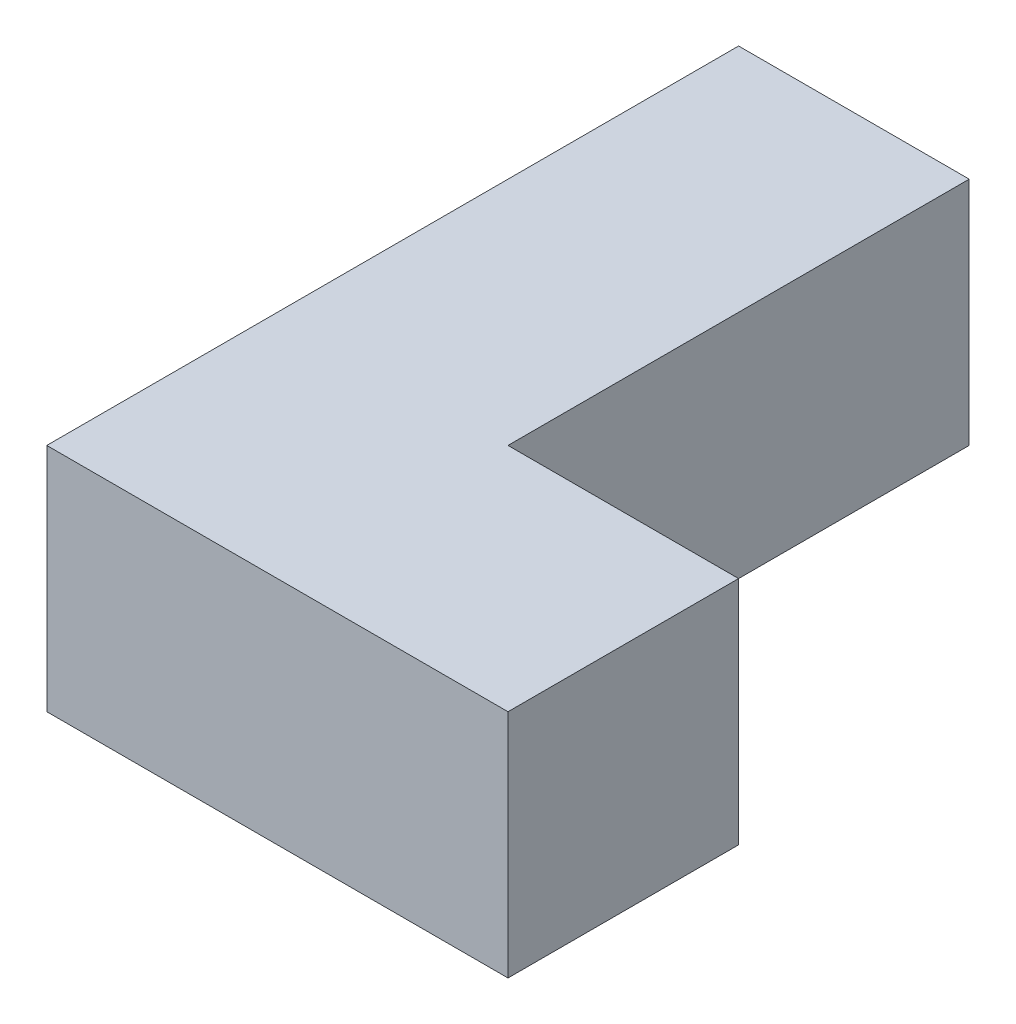
ISO-10303-21;
HEADER;
FILE_DESCRIPTION(('STEP AP214'),'2;1');
FILE_NAME('part.step','',(''),(''),'','','');
FILE_SCHEMA(('AUTOMOTIVE_DESIGN { 1 0 10303 214 1 1 1 1 }'));
ENDSEC;
DATA;
#1=APPLICATION_CONTEXT('core data for automotive mechanical design processes');
#2=APPLICATION_PROTOCOL_DEFINITION('international standard','automotive_design',2000,#1);
#3=PRODUCT_CONTEXT('',#1,'mechanical');
#4=PRODUCT('Part','Part','',(#3));
#5=PRODUCT_RELATED_PRODUCT_CATEGORY('part','',(#4));
#6=PRODUCT_DEFINITION_FORMATION('','',#4);
#7=PRODUCT_DEFINITION_CONTEXT('part definition',#1,'design');
#8=PRODUCT_DEFINITION('design','',#6,#7);
#9=PRODUCT_DEFINITION_SHAPE('','',#8);
#10=(LENGTH_UNIT() NAMED_UNIT(*) SI_UNIT(.MILLI.,.METRE.));
#11=(NAMED_UNIT(*) PLANE_ANGLE_UNIT() SI_UNIT($,.RADIAN.));
#12=(NAMED_UNIT(*) SI_UNIT($,.STERADIAN.) SOLID_ANGLE_UNIT());
#13=UNCERTAINTY_MEASURE_WITH_UNIT(LENGTH_MEASURE(1.E-05),#10,'distance_accuracy_value','');
#14=(GEOMETRIC_REPRESENTATION_CONTEXT(3) GLOBAL_UNCERTAINTY_ASSIGNED_CONTEXT((#13)) GLOBAL_UNIT_ASSIGNED_CONTEXT((#10,
#11,#12)) REPRESENTATION_CONTEXT('',''));
#15=CARTESIAN_POINT('',(0.,0.,0.));
#16=DIRECTION('',(0.,0.,1.));
#17=DIRECTION('',(1.,0.,0.));
#18=AXIS2_PLACEMENT_3D('',#15,#16,#17);
#19=CARTESIAN_POINT('',(0.,5000.,-7500.));
#20=DIRECTION('',(0.,0.,1.));
#21=DIRECTION('',(1.,0.,0.));
#22=AXIS2_PLACEMENT_3D('',#19,#20,#21);
#23=PLANE('',#22);
#24=DIRECTION('',(-1.,0.,0.));
#25=VECTOR('',#24,1.);
#26=CARTESIAN_POINT('',(0.,0.,-7500.));
#27=LINE('',#26,#25);
#28=CARTESIAN_POINT('',(0.,0.,-7500.));
#29=VERTEX_POINT('',#28);
#30=CARTESIAN_POINT('',(-5000.,0.,-7500.));
#31=VERTEX_POINT('',#30);
#32=EDGE_CURVE('E117',#29,#31,#27,.T.);
#33=ORIENTED_EDGE('',*,*,#32,.T.);
#34=DIRECTION('',(0.,-1.,0.));
#35=VECTOR('',#34,1.);
#36=CARTESIAN_POINT('',(-5000.,5000.,-7500.));
#37=LINE('',#36,#35);
#38=CARTESIAN_POINT('',(-5000.,5000.,-7500.));
#39=VERTEX_POINT('',#38);
#40=EDGE_CURVE('E11',#39,#31,#37,.T.);
#41=ORIENTED_EDGE('',*,*,#40,.F.);
#42=DIRECTION('',(-1.,0.,0.));
#43=VECTOR('',#42,1.);
#44=CARTESIAN_POINT('',(0.,5000.,-7500.));
#45=LINE('',#44,#43);
#46=CARTESIAN_POINT('',(0.,5000.,-7500.));
#47=VERTEX_POINT('',#46);
#48=EDGE_CURVE('E127',#47,#39,#45,.T.);
#49=ORIENTED_EDGE('',*,*,#48,.F.);
#50=DIRECTION('',(0.,-1.,0.));
#51=VECTOR('',#50,1.);
#52=CARTESIAN_POINT('',(0.,5000.,-7500.));
#53=LINE('',#52,#51);
#54=EDGE_CURVE('E113',#47,#29,#53,.T.);
#55=ORIENTED_EDGE('',*,*,#54,.T.);
#56=EDGE_LOOP('',(#33,#41,#49,#55));
#57=FACE_BOUND('',#56,.T.);
#58=ADVANCED_FACE('F33',(#57),#23,.F.);
#59=CARTESIAN_POINT('',(-5000.,5000.,-7500.));
#60=DIRECTION('',(1.,0.,0.));
#61=DIRECTION('',(0.,0.,-1.));
#62=AXIS2_PLACEMENT_3D('',#59,#60,#61);
#63=PLANE('',#62);
#64=DIRECTION('',(0.,0.,1.));
#65=VECTOR('',#64,1.);
#66=CARTESIAN_POINT('',(-5000.,0.,-7500.));
#67=LINE('',#66,#65);
#68=CARTESIAN_POINT('',(-5000.,0.,7500.));
#69=VERTEX_POINT('',#68);
#70=EDGE_CURVE('E120',#31,#69,#67,.T.);
#71=ORIENTED_EDGE('',*,*,#70,.T.);
#72=DIRECTION('',(0.,-1.,0.));
#73=VECTOR('',#72,1.);
#74=CARTESIAN_POINT('',(-5000.,5000.,7500.));
#75=LINE('',#74,#73);
#76=CARTESIAN_POINT('',(-5000.,5000.,7500.));
#77=VERTEX_POINT('',#76);
#78=EDGE_CURVE('E41',#77,#69,#75,.T.);
#79=ORIENTED_EDGE('',*,*,#78,.F.);
#80=DIRECTION('',(0.,0.,1.));
#81=VECTOR('',#80,1.);
#82=CARTESIAN_POINT('',(-5000.,5000.,-7500.));
#83=LINE('',#82,#81);
#84=EDGE_CURVE('E86',#39,#77,#83,.T.);
#85=ORIENTED_EDGE('',*,*,#84,.F.);
#86=ORIENTED_EDGE('',*,*,#40,.T.);
#87=EDGE_LOOP('',(#71,#79,#85,#86));
#88=FACE_BOUND('',#87,.T.);
#89=ADVANCED_FACE('F151',(#88),#63,.F.);
#90=CARTESIAN_POINT('',(-5000.,5000.,7500.));
#91=DIRECTION('',(0.,0.,-1.));
#92=DIRECTION('',(-1.,0.,0.));
#93=AXIS2_PLACEMENT_3D('',#90,#91,#92);
#94=PLANE('',#93);
#95=DIRECTION('',(1.,0.,0.));
#96=VECTOR('',#95,1.);
#97=CARTESIAN_POINT('',(-5000.,0.,7500.));
#98=LINE('',#97,#96);
#99=CARTESIAN_POINT('',(5000.,0.,7500.));
#100=VERTEX_POINT('',#99);
#101=EDGE_CURVE('E122',#69,#100,#98,.T.);
#102=ORIENTED_EDGE('',*,*,#101,.T.);
#103=DIRECTION('',(0.,-1.,0.));
#104=VECTOR('',#103,1.);
#105=CARTESIAN_POINT('',(5000.,5000.,7500.));
#106=LINE('',#105,#104);
#107=CARTESIAN_POINT('',(5000.,5000.,7500.));
#108=VERTEX_POINT('',#107);
#109=EDGE_CURVE('E108',#108,#100,#106,.T.);
#110=ORIENTED_EDGE('',*,*,#109,.F.);
#111=DIRECTION('',(1.,0.,0.));
#112=VECTOR('',#111,1.);
#113=CARTESIAN_POINT('',(-5000.,5000.,7500.));
#114=LINE('',#113,#112);
#115=EDGE_CURVE('E99',#77,#108,#114,.T.);
#116=ORIENTED_EDGE('',*,*,#115,.F.);
#117=ORIENTED_EDGE('',*,*,#78,.T.);
#118=EDGE_LOOP('',(#102,#110,#116,#117));
#119=FACE_BOUND('',#118,.T.);
#120=ADVANCED_FACE('F133',(#119),#94,.F.);
#121=CARTESIAN_POINT('',(5000.,5000.,7500.));
#122=DIRECTION('',(-1.,0.,0.));
#123=DIRECTION('',(0.,0.,1.));
#124=AXIS2_PLACEMENT_3D('',#121,#122,#123);
#125=PLANE('',#124);
#126=DIRECTION('',(0.,0.,-1.));
#127=VECTOR('',#126,1.);
#128=CARTESIAN_POINT('',(5000.,0.,7500.));
#129=LINE('',#128,#127);
#130=CARTESIAN_POINT('',(5000.,0.,2500.));
#131=VERTEX_POINT('',#130);
#132=EDGE_CURVE('E107',#100,#131,#129,.T.);
#133=ORIENTED_EDGE('',*,*,#132,.T.);
#134=DIRECTION('',(0.,-1.,0.));
#135=VECTOR('',#134,1.);
#136=CARTESIAN_POINT('',(5000.,5000.,2500.));
#137=LINE('',#136,#135);
#138=CARTESIAN_POINT('',(5000.,5000.,2500.));
#139=VERTEX_POINT('',#138);
#140=EDGE_CURVE('E104',#139,#131,#137,.T.);
#141=ORIENTED_EDGE('',*,*,#140,.F.);
#142=DIRECTION('',(0.,0.,-1.));
#143=VECTOR('',#142,1.);
#144=CARTESIAN_POINT('',(5000.,5000.,7500.));
#145=LINE('',#144,#143);
#146=EDGE_CURVE('E93',#108,#139,#145,.T.);
#147=ORIENTED_EDGE('',*,*,#146,.F.);
#148=ORIENTED_EDGE('',*,*,#109,.T.);
#149=EDGE_LOOP('',(#133,#141,#147,#148));
#150=FACE_BOUND('',#149,.T.);
#151=ADVANCED_FACE('F105',(#150),#125,.F.);
#152=CARTESIAN_POINT('',(5000.,5000.,2500.));
#153=DIRECTION('',(0.,0.,1.));
#154=DIRECTION('',(1.,0.,0.));
#155=AXIS2_PLACEMENT_3D('',#152,#153,#154);
#156=PLANE('',#155);
#157=DIRECTION('',(-1.,0.,0.));
#158=VECTOR('',#157,1.);
#159=CARTESIAN_POINT('',(5000.,0.,2500.));
#160=LINE('',#159,#158);
#161=CARTESIAN_POINT('',(0.,0.,2500.));
#162=VERTEX_POINT('',#161);
#163=EDGE_CURVE('E72',#131,#162,#160,.T.);
#164=ORIENTED_EDGE('',*,*,#163,.T.);
#165=DIRECTION('',(0.,-1.,0.));
#166=VECTOR('',#165,1.);
#167=CARTESIAN_POINT('',(0.,5000.,2500.));
#168=LINE('',#167,#166);
#169=CARTESIAN_POINT('',(0.,5000.,2500.));
#170=VERTEX_POINT('',#169);
#171=EDGE_CURVE('E109',#170,#162,#168,.T.);
#172=ORIENTED_EDGE('',*,*,#171,.F.);
#173=DIRECTION('',(-1.,0.,0.));
#174=VECTOR('',#173,1.);
#175=CARTESIAN_POINT('',(5000.,5000.,2500.));
#176=LINE('',#175,#174);
#177=EDGE_CURVE('E97',#139,#170,#176,.T.);
#178=ORIENTED_EDGE('',*,*,#177,.F.);
#179=ORIENTED_EDGE('',*,*,#140,.T.);
#180=EDGE_LOOP('',(#164,#172,#178,#179));
#181=FACE_BOUND('',#180,.T.);
#182=ADVANCED_FACE('F111',(#181),#156,.F.);
#183=CARTESIAN_POINT('',(0.,5000.,2500.));
#184=DIRECTION('',(-1.,0.,0.));
#185=DIRECTION('',(0.,0.,1.));
#186=AXIS2_PLACEMENT_3D('',#183,#184,#185);
#187=PLANE('',#186);
#188=DIRECTION('',(0.,0.,-1.));
#189=VECTOR('',#188,1.);
#190=CARTESIAN_POINT('',(0.,0.,2500.));
#191=LINE('',#190,#189);
#192=EDGE_CURVE('E78',#162,#29,#191,.T.);
#193=ORIENTED_EDGE('',*,*,#192,.T.);
#194=ORIENTED_EDGE('',*,*,#54,.F.);
#195=DIRECTION('',(0.,0.,-1.));
#196=VECTOR('',#195,1.);
#197=CARTESIAN_POINT('',(0.,5000.,2500.));
#198=LINE('',#197,#196);
#199=EDGE_CURVE('E49',#170,#47,#198,.T.);
#200=ORIENTED_EDGE('',*,*,#199,.F.);
#201=ORIENTED_EDGE('',*,*,#171,.T.);
#202=EDGE_LOOP('',(#193,#194,#200,#201));
#203=FACE_BOUND('',#202,.T.);
#204=ADVANCED_FACE('F140',(#203),#187,.F.);
#205=CARTESIAN_POINT('',(0.,5000.,0.));
#206=DIRECTION('',(0.,1.,0.));
#207=DIRECTION('',(0.,0.,1.));
#208=AXIS2_PLACEMENT_3D('',#205,#206,#207);
#209=PLANE('',#208);
#210=ORIENTED_EDGE('',*,*,#48,.T.);
#211=ORIENTED_EDGE('',*,*,#84,.T.);
#212=ORIENTED_EDGE('',*,*,#115,.T.);
#213=ORIENTED_EDGE('',*,*,#146,.T.);
#214=ORIENTED_EDGE('',*,*,#177,.T.);
#215=ORIENTED_EDGE('',*,*,#199,.T.);
#216=EDGE_LOOP('',(#210,#211,#212,#213,#214,#215));
#217=FACE_BOUND('',#216,.T.);
#218=ADVANCED_FACE('F95',(#217),#209,.T.);
#219=CARTESIAN_POINT('',(0.,0.,0.));
#220=DIRECTION('',(0.,1.,0.));
#221=DIRECTION('',(0.,0.,1.));
#222=AXIS2_PLACEMENT_3D('',#219,#220,#221);
#223=PLANE('',#222);
#224=ORIENTED_EDGE('',*,*,#32,.F.);
#225=ORIENTED_EDGE('',*,*,#192,.F.);
#226=ORIENTED_EDGE('',*,*,#163,.F.);
#227=ORIENTED_EDGE('',*,*,#132,.F.);
#228=ORIENTED_EDGE('',*,*,#101,.F.);
#229=ORIENTED_EDGE('',*,*,#70,.F.);
#230=EDGE_LOOP('',(#224,#225,#226,#227,#228,#229));
#231=FACE_BOUND('',#230,.T.);
#232=ADVANCED_FACE('F136',(#231),#223,.F.);
#233=CLOSED_SHELL('',(#58,#89,#120,#151,#182,#204,#218,#232));
#234=MANIFOLD_SOLID_BREP('B2',#233);
#235=ADVANCED_BREP_SHAPE_REPRESENTATION('',(#18,#234),#14);
#236=SHAPE_DEFINITION_REPRESENTATION(#9,#235);
ENDSEC;
END-ISO-10303-21;
